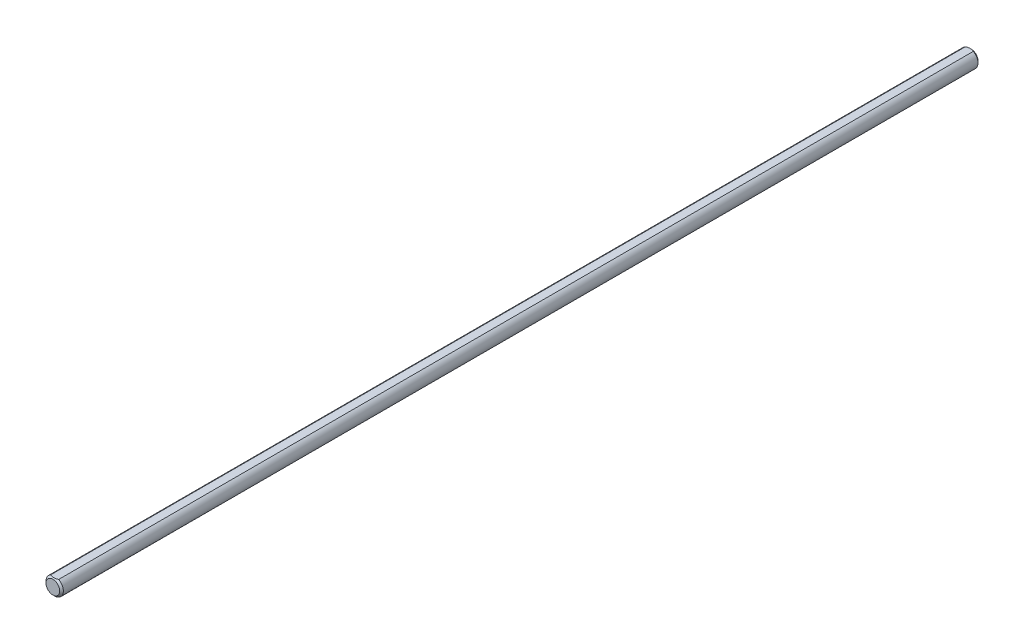
ISO-10303-21;
HEADER;
FILE_DESCRIPTION(('STEP AP214'),'2;1');
FILE_NAME('part.step','',(''),(''),'','','');
FILE_SCHEMA(('AUTOMOTIVE_DESIGN { 1 0 10303 214 1 1 1 1 }'));
ENDSEC;
DATA;
#1=APPLICATION_CONTEXT('core data for automotive mechanical design processes');
#2=APPLICATION_PROTOCOL_DEFINITION('international standard','automotive_design',2000,#1);
#3=PRODUCT_CONTEXT('',#1,'mechanical');
#4=PRODUCT('Part','Part','',(#3));
#5=PRODUCT_RELATED_PRODUCT_CATEGORY('part','',(#4));
#6=PRODUCT_DEFINITION_FORMATION('','',#4);
#7=PRODUCT_DEFINITION_CONTEXT('part definition',#1,'design');
#8=PRODUCT_DEFINITION('design','',#6,#7);
#9=PRODUCT_DEFINITION_SHAPE('','',#8);
#10=(LENGTH_UNIT() NAMED_UNIT(*) SI_UNIT(.MILLI.,.METRE.));
#11=(NAMED_UNIT(*) PLANE_ANGLE_UNIT() SI_UNIT($,.RADIAN.));
#12=(NAMED_UNIT(*) SI_UNIT($,.STERADIAN.) SOLID_ANGLE_UNIT());
#13=UNCERTAINTY_MEASURE_WITH_UNIT(LENGTH_MEASURE(1.E-05),#10,'distance_accuracy_value','');
#14=(GEOMETRIC_REPRESENTATION_CONTEXT(3) GLOBAL_UNCERTAINTY_ASSIGNED_CONTEXT((#13)) GLOBAL_UNIT_ASSIGNED_CONTEXT((#10,
#11,#12)) REPRESENTATION_CONTEXT('',''));
#15=CARTESIAN_POINT('',(0.,0.,0.));
#16=DIRECTION('',(0.,0.,1.));
#17=DIRECTION('',(1.,0.,0.));
#18=AXIS2_PLACEMENT_3D('',#15,#16,#17);
#19=CARTESIAN_POINT('',(0.,0.,125.));
#20=DIRECTION('',(0.,0.,1.));
#21=DIRECTION('',(1.,0.,0.));
#22=AXIS2_PLACEMENT_3D('',#19,#20,#21);
#23=PLANE('',#22);
#24=CARTESIAN_POINT('',(0.,0.,125.));
#25=DIRECTION('',(0.,0.,1.));
#26=DIRECTION('',(1.,0.,0.));
#27=AXIS2_PLACEMENT_3D('',#24,#25,#26);
#28=CIRCLE('',#27,1.86500000000001);
#29=CARTESIAN_POINT('',(0.85779075186574,1.65602536997886,125.));
#30=VERTEX_POINT('',#29);
#31=EDGE_CURVE('E43',#30,#30,#28,.T.);
#32=ORIENTED_EDGE('',*,*,#31,.T.);
#33=EDGE_LOOP('',(#32));
#34=FACE_BOUND('',#33,.T.);
#35=ADVANCED_FACE('F34',(#34),#23,.T.);
#36=CARTESIAN_POINT('',(1.0877614628217,2.1,-125.));
#37=DIRECTION('',(0.,1.,0.));
#38=DIRECTION('',(0.,0.,1.));
#39=AXIS2_PLACEMENT_3D('',#36,#37,#38);
#40=PLANE('',#39);
#41=DIRECTION('',(0.,0.,1.));
#42=VECTOR('',#41,1.);
#43=CARTESIAN_POINT('',(-1.0877614628217,2.1,-125.));
#44=LINE('',#43,#42);
#45=CARTESIAN_POINT('',(-1.0877614628217,2.1,124.5));
#46=VERTEX_POINT('',#45);
#47=CARTESIAN_POINT('',(-1.0877614628217,2.1,-124.5));
#48=VERTEX_POINT('',#47);
#49=EDGE_CURVE('E78',#46,#48,#44,.F.);
#50=ORIENTED_EDGE('',*,*,#49,.F.);
#51=CARTESIAN_POINT('',(-1.0877614628217,2.1,124.5));
#52=CARTESIAN_POINT('',(-1.01051227995232,2.1,124.535516643696));
#53=CARTESIAN_POINT('',(-0.932030141957778,2.1,124.568644889772));
#54=CARTESIAN_POINT('',(-0.772375914107161,2.1,124.62869587003));
#55=CARTESIAN_POINT('',(-0.691194051547242,2.1,124.655592404465));
#56=CARTESIAN_POINT('',(-0.529163189732153,2.1,124.700706131051));
#57=CARTESIAN_POINT('',(-0.448385067196345,2.1,124.719171212335));
#58=CARTESIAN_POINT('',(-0.285400949598047,2.1,124.747210388464));
#59=CARTESIAN_POINT('',(-0.203197572119483,2.1,124.756799320083));
#60=CARTESIAN_POINT('',(-0.0446059633340479,2.1,124.765901500507));
#61=CARTESIAN_POINT('',(0.0317405422601431,2.1,124.766136362144));
#62=CARTESIAN_POINT('',(0.18403364337686,2.1,124.758324612168));
#63=CARTESIAN_POINT('',(0.259980046879146,2.1,124.750274333992));
#64=CARTESIAN_POINT('',(0.411721451024039,2.1,124.726352708519));
#65=CARTESIAN_POINT('',(0.487498683628943,2.1,124.710370928884));
#66=CARTESIAN_POINT('',(0.637257077773619,2.1,124.671632346258));
#67=CARTESIAN_POINT('',(0.711238352113125,2.1,124.648875969959));
#68=CARTESIAN_POINT('',(0.924121619382719,2.1,124.574414090544));
#69=CARTESIAN_POINT('',(1.06041024386196,2.1,124.515286200733));
#70=CARTESIAN_POINT('',(1.32668597919908,2.1,124.383748269244));
#71=CARTESIAN_POINT('',(1.45664997587017,2.1,124.311293549518));
#72=CARTESIAN_POINT('',(1.64572059742671,2.1,124.19741559593));
#73=CARTESIAN_POINT('',(1.70682590239475,2.1,124.159243976876));
#74=CARTESIAN_POINT('',(1.82797417951267,2.1,124.081237682044));
#75=CARTESIAN_POINT('',(1.88801706724527,2.1,124.041402874949));
#76=CARTESIAN_POINT('',(2.00670237526684,2.1,123.960697036451));
#77=CARTESIAN_POINT('',(2.06535212626102,2.1,123.919836730252));
#78=CARTESIAN_POINT('',(2.18183732390516,2.1,123.837005125758));
#79=CARTESIAN_POINT('',(2.23967299999674,2.1,123.795034150507));
#80=CARTESIAN_POINT('',(2.29716793167674,2.1,123.752608555094));
#81=B_SPLINE_CURVE_WITH_KNOTS('',3,(#51,#52,#53,#54,#55,#56,#57,#58,#59,#60,#61,#62,#63,#64,#65,
#66,#67,#68,#69,#70,#71,#72,#73,#74,#75,#76,#77,#78,#79,#80),.UNSPECIFIED.,.F.,.F.,(4,2,2,2,2,2,
2,2,2,2,2,2,2,2,4),(0.,0.255213480183374,0.511481225130007,0.759633290685768,1.00736980901807,
1.23595458785722,1.46464056969116,1.69660390889243,1.92855264115294,2.37298715221101,
2.81893971985394,3.03506287508594,3.25120312655492,3.46562900506902,3.67999318755219),.UNSPECIFIED.);
#82=CARTESIAN_POINT('',(1.0877614628217,2.1,124.5));
#83=VERTEX_POINT('',#82);
#84=EDGE_CURVE('E64',#46,#83,#81,.T.);
#85=ORIENTED_EDGE('',*,*,#84,.T.);
#86=DIRECTION('',(0.,0.,1.));
#87=VECTOR('',#86,1.);
#88=CARTESIAN_POINT('',(1.0877614628217,2.1,-125.));
#89=LINE('',#88,#87);
#90=CARTESIAN_POINT('',(1.0877614628217,2.1,-124.5));
#91=VERTEX_POINT('',#90);
#92=EDGE_CURVE('E80',#91,#83,#89,.T.);
#93=ORIENTED_EDGE('',*,*,#92,.F.);
#94=CARTESIAN_POINT('',(1.0877614628217,2.1,-124.5));
#95=CARTESIAN_POINT('',(1.01051227995232,2.1,-124.535516643696));
#96=CARTESIAN_POINT('',(0.932030141957779,2.1,-124.568644889772));
#97=CARTESIAN_POINT('',(0.772375914107162,2.1,-124.62869587003));
#98=CARTESIAN_POINT('',(0.691194051547242,2.1,-124.655592404465));
#99=CARTESIAN_POINT('',(0.529163189732153,2.1,-124.700706131051));
#100=CARTESIAN_POINT('',(0.448385067196346,2.1,-124.719171212335));
#101=CARTESIAN_POINT('',(0.285400949598048,2.1,-124.747210388464));
#102=CARTESIAN_POINT('',(0.203197572119483,2.1,-124.756799320083));
#103=CARTESIAN_POINT('',(0.0446059633340486,2.1,-124.765901500507));
#104=CARTESIAN_POINT('',(-0.0317405422601423,2.1,-124.766136362144));
#105=CARTESIAN_POINT('',(-0.184033643376859,2.1,-124.758324612168));
#106=CARTESIAN_POINT('',(-0.259980046879145,2.1,-124.750274333992));
#107=CARTESIAN_POINT('',(-0.411721451024038,2.1,-124.726352708519));
#108=CARTESIAN_POINT('',(-0.487498683628942,2.1,-124.710370928884));
#109=CARTESIAN_POINT('',(-0.637257077773618,2.1,-124.671632346258));
#110=CARTESIAN_POINT('',(-0.711238352113124,2.1,-124.648875969959));
#111=CARTESIAN_POINT('',(-0.924121619382719,2.1,-124.574414090544));
#112=CARTESIAN_POINT('',(-1.06041024386195,2.1,-124.515286200733));
#113=CARTESIAN_POINT('',(-1.32668597919908,2.1,-124.383748269244));
#114=CARTESIAN_POINT('',(-1.45664997587018,2.1,-124.311293549518));
#115=CARTESIAN_POINT('',(-1.64572059742671,2.1,-124.19741559593));
#116=CARTESIAN_POINT('',(-1.70682590239474,2.1,-124.159243976876));
#117=CARTESIAN_POINT('',(-1.82797417951267,2.1,-124.081237682044));
#118=CARTESIAN_POINT('',(-1.88801706724527,2.1,-124.041402874949));
#119=CARTESIAN_POINT('',(-2.00670237526684,2.1,-123.960697036451));
#120=CARTESIAN_POINT('',(-2.06535212626101,2.1,-123.919836730252));
#121=CARTESIAN_POINT('',(-2.18183732390515,2.1,-123.837005125758));
#122=CARTESIAN_POINT('',(-2.23967299999673,2.1,-123.795034150507));
#123=CARTESIAN_POINT('',(-2.29716793167674,2.1,-123.752608555094));
#124=B_SPLINE_CURVE_WITH_KNOTS('',3,(#94,#95,#96,#97,#98,#99,#100,#101,#102,#103,#104,#105,#106,
#107,#108,#109,#110,#111,#112,#113,#114,#115,#116,#117,#118,#119,#120,#121,#122,#123),
.UNSPECIFIED.,.F.,.F.,(4,2,2,2,2,2,2,2,2,2,2,2,2,2,4),(0.,0.255213480183375,0.511481225130008,
0.759633290685768,1.00736980901807,1.23595458785722,1.46464056969116,1.69660390889243,
1.92855264115294,2.37298715221101,2.81893971985394,3.03506287508594,3.25120312655492,
3.46562900506901,3.67999318755219),.UNSPECIFIED.);
#125=EDGE_CURVE('E72',#91,#48,#124,.T.);
#126=ORIENTED_EDGE('',*,*,#125,.T.);
#127=EDGE_LOOP('',(#50,#85,#93,#126));
#128=FACE_BOUND('',#127,.T.);
#129=ADVANCED_FACE('F83',(#128),#40,.T.);
#130=CARTESIAN_POINT('',(0.,0.,-125.));
#131=DIRECTION('',(0.,0.,1.));
#132=DIRECTION('',(1.,0.,0.));
#133=AXIS2_PLACEMENT_3D('',#130,#131,#132);
#134=PLANE('',#133);
#135=CARTESIAN_POINT('',(0.,0.,-125.));
#136=DIRECTION('',(0.,0.,1.));
#137=DIRECTION('',(1.,0.,0.));
#138=AXIS2_PLACEMENT_3D('',#135,#136,#137);
#139=CIRCLE('',#138,1.86500000000001);
#140=CARTESIAN_POINT('',(-0.85779075186574,1.65602536997886,-125.));
#141=VERTEX_POINT('',#140);
#142=EDGE_CURVE('E11',#141,#141,#139,.F.);
#143=ORIENTED_EDGE('',*,*,#142,.T.);
#144=EDGE_LOOP('',(#143));
#145=FACE_BOUND('',#144,.T.);
#146=ADVANCED_FACE('F99',(#145),#134,.F.);
#147=CARTESIAN_POINT('',(0.,0.,-125.));
#148=DIRECTION('',(0.,0.,1.));
#149=DIRECTION('',(1.,0.,0.));
#150=AXIS2_PLACEMENT_3D('',#147,#148,#149);
#151=CYLINDRICAL_SURFACE('',#150,2.365);
#152=ORIENTED_EDGE('',*,*,#92,.T.);
#153=CARTESIAN_POINT('',(0.,0.,124.5));
#154=DIRECTION('',(0.,0.,1.));
#155=DIRECTION('',(1.,0.,0.));
#156=AXIS2_PLACEMENT_3D('',#153,#154,#155);
#157=CIRCLE('',#156,2.365);
#158=EDGE_CURVE('E67',#83,#46,#157,.F.);
#159=ORIENTED_EDGE('',*,*,#158,.T.);
#160=ORIENTED_EDGE('',*,*,#49,.T.);
#161=CARTESIAN_POINT('',(0.,0.,-124.5));
#162=DIRECTION('',(0.,0.,1.));
#163=DIRECTION('',(1.,0.,0.));
#164=AXIS2_PLACEMENT_3D('',#161,#162,#163);
#165=CIRCLE('',#164,2.365);
#166=EDGE_CURVE('E81',#48,#91,#165,.T.);
#167=ORIENTED_EDGE('',*,*,#166,.T.);
#168=EDGE_LOOP('',(#152,#159,#160,#167));
#169=FACE_BOUND('',#168,.T.);
#170=ADVANCED_FACE('F76',(#169),#151,.T.);
#171=CARTESIAN_POINT('',(0.,0.,124.5));
#172=DIRECTION('',(0.,0.,-1.));
#173=DIRECTION('',(-1.,0.,0.));
#174=AXIS2_PLACEMENT_3D('',#171,#172,#173);
#175=CONICAL_SURFACE('',#174,2.365,0.785398163397443);
#176=ORIENTED_EDGE('',*,*,#31,.F.);
#177=EDGE_LOOP('',(#176));
#178=FACE_BOUND('',#177,.T.);
#179=ORIENTED_EDGE('',*,*,#84,.F.);
#180=ORIENTED_EDGE('',*,*,#158,.F.);
#181=EDGE_LOOP('',(#179,#180));
#182=FACE_BOUND('',#181,.T.);
#183=ADVANCED_FACE('F66',(#178,#182),#175,.T.);
#184=CARTESIAN_POINT('',(0.,0.,-124.5));
#185=DIRECTION('',(0.,0.,1.));
#186=DIRECTION('',(1.,0.,0.));
#187=AXIS2_PLACEMENT_3D('',#184,#185,#186);
#188=CONICAL_SURFACE('',#187,2.365,0.785398163397443);
#189=ORIENTED_EDGE('',*,*,#142,.F.);
#190=EDGE_LOOP('',(#189));
#191=FACE_BOUND('',#190,.T.);
#192=ORIENTED_EDGE('',*,*,#125,.F.);
#193=ORIENTED_EDGE('',*,*,#166,.F.);
#194=EDGE_LOOP('',(#192,#193));
#195=FACE_BOUND('',#194,.T.);
#196=ADVANCED_FACE('F36',(#191,#195),#188,.T.);
#197=CLOSED_SHELL('',(#35,#129,#146,#170,#183,#196));
#198=MANIFOLD_SOLID_BREP('B2',#197);
#199=ADVANCED_BREP_SHAPE_REPRESENTATION('',(#18,#198),#14);
#200=SHAPE_DEFINITION_REPRESENTATION(#9,#199);
ENDSEC;
END-ISO-10303-21;
